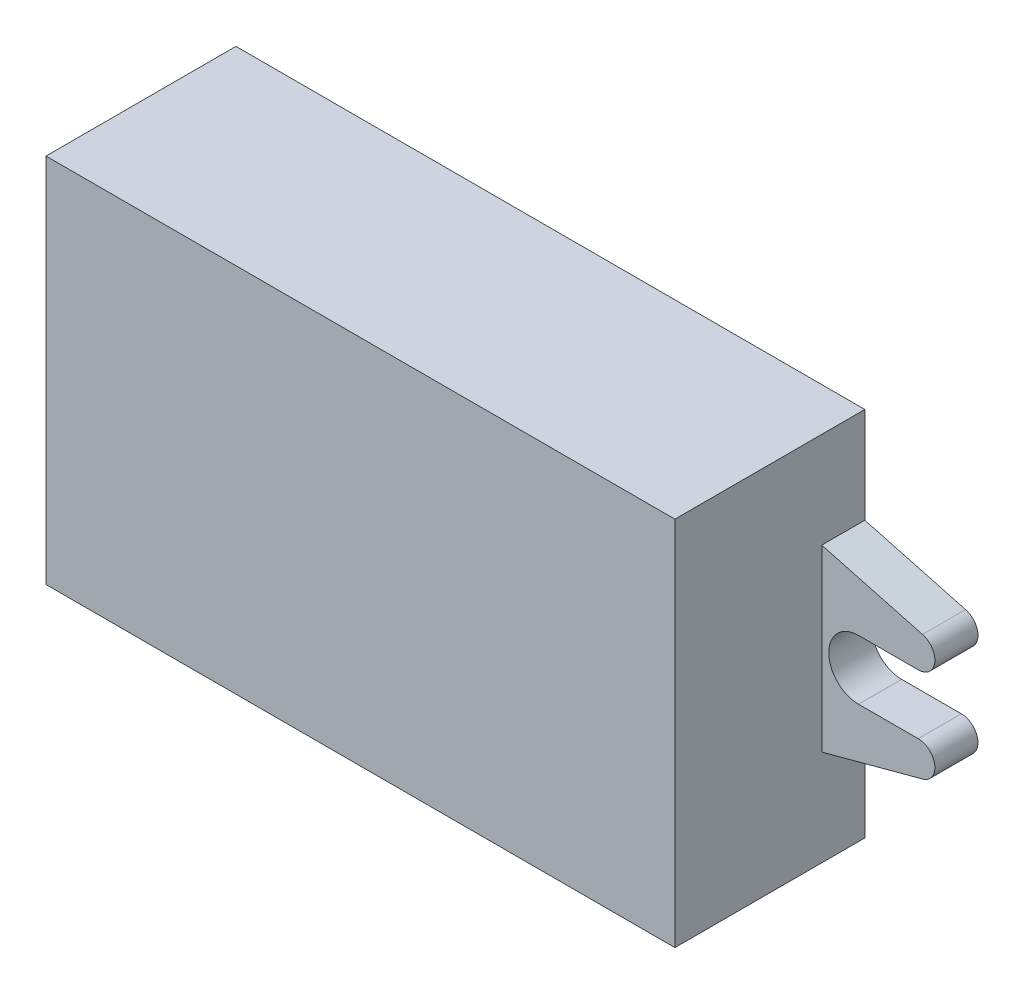
ISO-10303-21;
HEADER;
FILE_DESCRIPTION(('STEP AP214'),'2;1');
FILE_NAME('part.step','',(''),(''),'','','');
FILE_SCHEMA(('AUTOMOTIVE_DESIGN { 1 0 10303 214 1 1 1 1 }'));
ENDSEC;
DATA;
#1=APPLICATION_CONTEXT('core data for automotive mechanical design processes');
#2=APPLICATION_PROTOCOL_DEFINITION('international standard','automotive_design',2000,#1);
#3=PRODUCT_CONTEXT('',#1,'mechanical');
#4=PRODUCT('Part','Part','',(#3));
#5=PRODUCT_RELATED_PRODUCT_CATEGORY('part','',(#4));
#6=PRODUCT_DEFINITION_FORMATION('','',#4);
#7=PRODUCT_DEFINITION_CONTEXT('part definition',#1,'design');
#8=PRODUCT_DEFINITION('design','',#6,#7);
#9=PRODUCT_DEFINITION_SHAPE('','',#8);
#10=(LENGTH_UNIT() NAMED_UNIT(*) SI_UNIT(.MILLI.,.METRE.));
#11=(NAMED_UNIT(*) PLANE_ANGLE_UNIT() SI_UNIT($,.RADIAN.));
#12=(NAMED_UNIT(*) SI_UNIT($,.STERADIAN.) SOLID_ANGLE_UNIT());
#13=UNCERTAINTY_MEASURE_WITH_UNIT(LENGTH_MEASURE(1.E-05),#10,'distance_accuracy_value','');
#14=(GEOMETRIC_REPRESENTATION_CONTEXT(3) GLOBAL_UNCERTAINTY_ASSIGNED_CONTEXT((#13)) GLOBAL_UNIT_ASSIGNED_CONTEXT((#10,
#11,#12)) REPRESENTATION_CONTEXT('',''));
#15=CARTESIAN_POINT('',(0.,0.,0.));
#16=DIRECTION('',(0.,0.,1.));
#17=DIRECTION('',(1.,0.,0.));
#18=AXIS2_PLACEMENT_3D('',#15,#16,#17);
#19=CARTESIAN_POINT('',(-23.175,-13.675,14.));
#20=DIRECTION('',(1.,0.,0.));
#21=DIRECTION('',(0.,0.,-1.));
#22=AXIS2_PLACEMENT_3D('',#19,#20,#21);
#23=PLANE('',#22);
#24=DIRECTION('',(0.,0.,-1.));
#25=VECTOR('',#24,1.);
#26=CARTESIAN_POINT('',(-23.175,6.60413434886178,3.175));
#27=LINE('',#26,#25);
#28=CARTESIAN_POINT('',(-23.175,6.60413434886178,3.175));
#29=VERTEX_POINT('',#28);
#30=CARTESIAN_POINT('',(-23.175,6.60413434886178,0.));
#31=VERTEX_POINT('',#30);
#32=EDGE_CURVE('E192',#29,#31,#27,.T.);
#33=ORIENTED_EDGE('',*,*,#32,.F.);
#34=DIRECTION('',(0.,-1.,0.));
#35=VECTOR('',#34,1.);
#36=CARTESIAN_POINT('',(-23.175,6.60413434886178,3.175));
#37=LINE('',#36,#35);
#38=CARTESIAN_POINT('',(-23.175,-6.60413434886178,3.175));
#39=VERTEX_POINT('',#38);
#40=EDGE_CURVE('E177',#29,#39,#37,.T.);
#41=ORIENTED_EDGE('',*,*,#40,.T.);
#42=DIRECTION('',(0.,0.,-1.));
#43=VECTOR('',#42,1.);
#44=CARTESIAN_POINT('',(-23.175,-6.60413434886178,3.175));
#45=LINE('',#44,#43);
#46=CARTESIAN_POINT('',(-23.175,-6.60413434886178,0.));
#47=VERTEX_POINT('',#46);
#48=EDGE_CURVE('E313',#39,#47,#45,.T.);
#49=ORIENTED_EDGE('',*,*,#48,.T.);
#50=DIRECTION('',(0.,-1.,0.));
#51=VECTOR('',#50,1.);
#52=CARTESIAN_POINT('',(-23.175,-13.675,0.));
#53=LINE('',#52,#51);
#54=CARTESIAN_POINT('',(-23.175,-13.675,0.));
#55=VERTEX_POINT('',#54);
#56=EDGE_CURVE('E275',#47,#55,#53,.T.);
#57=ORIENTED_EDGE('',*,*,#56,.T.);
#58=DIRECTION('',(0.,0.,-1.));
#59=VECTOR('',#58,1.);
#60=CARTESIAN_POINT('',(-23.175,-13.675,14.));
#61=LINE('',#60,#59);
#62=CARTESIAN_POINT('',(-23.175,-13.675,14.));
#63=VERTEX_POINT('',#62);
#64=EDGE_CURVE('E280',#63,#55,#61,.T.);
#65=ORIENTED_EDGE('',*,*,#64,.F.);
#66=DIRECTION('',(0.,-1.,0.));
#67=VECTOR('',#66,1.);
#68=CARTESIAN_POINT('',(-23.175,-13.675,14.));
#69=LINE('',#68,#67);
#70=CARTESIAN_POINT('',(-23.175,13.675,14.));
#71=VERTEX_POINT('',#70);
#72=EDGE_CURVE('E265',#71,#63,#69,.T.);
#73=ORIENTED_EDGE('',*,*,#72,.F.);
#74=DIRECTION('',(0.,0.,-1.));
#75=VECTOR('',#74,1.);
#76=CARTESIAN_POINT('',(-23.175,13.675,14.));
#77=LINE('',#76,#75);
#78=CARTESIAN_POINT('',(-23.175,13.675,0.));
#79=VERTEX_POINT('',#78);
#80=EDGE_CURVE('E45',#71,#79,#77,.T.);
#81=ORIENTED_EDGE('',*,*,#80,.T.);
#82=EDGE_CURVE('E200',#79,#31,#53,.T.);
#83=ORIENTED_EDGE('',*,*,#82,.T.);
#84=EDGE_LOOP('',(#33,#41,#49,#57,#65,#73,#81,#83));
#85=FACE_BOUND('',#84,.T.);
#86=ADVANCED_FACE('F37',(#85),#23,.F.);
#87=CARTESIAN_POINT('',(23.175,-13.675,14.));
#88=DIRECTION('',(-1.,0.,0.));
#89=DIRECTION('',(0.,0.,1.));
#90=AXIS2_PLACEMENT_3D('',#87,#88,#89);
#91=PLANE('',#90);
#92=DIRECTION('',(0.,0.,-1.));
#93=VECTOR('',#92,1.);
#94=CARTESIAN_POINT('',(23.175,-6.60413434886178,3.175));
#95=LINE('',#94,#93);
#96=CARTESIAN_POINT('',(23.175,-6.60413434886178,3.175));
#97=VERTEX_POINT('',#96);
#98=CARTESIAN_POINT('',(23.175,-6.60413434886178,0.));
#99=VERTEX_POINT('',#98);
#100=EDGE_CURVE('E255',#97,#99,#95,.T.);
#101=ORIENTED_EDGE('',*,*,#100,.F.);
#102=DIRECTION('',(0.,-1.,0.));
#103=VECTOR('',#102,1.);
#104=CARTESIAN_POINT('',(23.175,6.60413434886178,3.175));
#105=LINE('',#104,#103);
#106=CARTESIAN_POINT('',(23.175,6.60413434886178,3.175));
#107=VERTEX_POINT('',#106);
#108=EDGE_CURVE('E209',#107,#97,#105,.T.);
#109=ORIENTED_EDGE('',*,*,#108,.F.);
#110=DIRECTION('',(0.,0.,-1.));
#111=VECTOR('',#110,1.);
#112=CARTESIAN_POINT('',(23.175,6.60413434886178,3.175));
#113=LINE('',#112,#111);
#114=CARTESIAN_POINT('',(23.175,6.60413434886178,0.));
#115=VERTEX_POINT('',#114);
#116=EDGE_CURVE('E225',#107,#115,#113,.T.);
#117=ORIENTED_EDGE('',*,*,#116,.T.);
#118=DIRECTION('',(0.,1.,0.));
#119=VECTOR('',#118,1.);
#120=CARTESIAN_POINT('',(23.175,-13.675,0.));
#121=LINE('',#120,#119);
#122=CARTESIAN_POINT('',(23.175,13.675,0.));
#123=VERTEX_POINT('',#122);
#124=EDGE_CURVE('E258',#115,#123,#121,.T.);
#125=ORIENTED_EDGE('',*,*,#124,.T.);
#126=DIRECTION('',(0.,0.,-1.));
#127=VECTOR('',#126,1.);
#128=CARTESIAN_POINT('',(23.175,13.675,14.));
#129=LINE('',#128,#127);
#130=CARTESIAN_POINT('',(23.175,13.675,14.));
#131=VERTEX_POINT('',#130);
#132=EDGE_CURVE('E11',#131,#123,#129,.T.);
#133=ORIENTED_EDGE('',*,*,#132,.F.);
#134=DIRECTION('',(0.,1.,0.));
#135=VECTOR('',#134,1.);
#136=CARTESIAN_POINT('',(23.175,-13.675,14.));
#137=LINE('',#136,#135);
#138=CARTESIAN_POINT('',(23.175,-13.675,14.));
#139=VERTEX_POINT('',#138);
#140=EDGE_CURVE('E259',#139,#131,#137,.T.);
#141=ORIENTED_EDGE('',*,*,#140,.F.);
#142=DIRECTION('',(0.,0.,-1.));
#143=VECTOR('',#142,1.);
#144=CARTESIAN_POINT('',(23.175,-13.675,14.));
#145=LINE('',#144,#143);
#146=CARTESIAN_POINT('',(23.175,-13.675,0.));
#147=VERTEX_POINT('',#146);
#148=EDGE_CURVE('E269',#139,#147,#145,.T.);
#149=ORIENTED_EDGE('',*,*,#148,.T.);
#150=EDGE_CURVE('E270',#147,#99,#121,.T.);
#151=ORIENTED_EDGE('',*,*,#150,.T.);
#152=EDGE_LOOP('',(#101,#109,#117,#125,#133,#141,#149,#151));
#153=FACE_BOUND('',#152,.T.);
#154=ADVANCED_FACE('F39',(#153),#91,.F.);
#155=CARTESIAN_POINT('',(-23.175,13.675,14.));
#156=DIRECTION('',(0.,-1.,0.));
#157=DIRECTION('',(0.,0.,-1.));
#158=AXIS2_PLACEMENT_3D('',#155,#156,#157);
#159=PLANE('',#158);
#160=DIRECTION('',(-1.,0.,0.));
#161=VECTOR('',#160,1.);
#162=CARTESIAN_POINT('',(-23.175,13.675,0.));
#163=LINE('',#162,#161);
#164=EDGE_CURVE('E273',#123,#79,#163,.T.);
#165=ORIENTED_EDGE('',*,*,#164,.T.);
#166=ORIENTED_EDGE('',*,*,#80,.F.);
#167=DIRECTION('',(-1.,0.,0.));
#168=VECTOR('',#167,1.);
#169=CARTESIAN_POINT('',(-23.175,13.675,14.));
#170=LINE('',#169,#168);
#171=EDGE_CURVE('E262',#131,#71,#170,.T.);
#172=ORIENTED_EDGE('',*,*,#171,.F.);
#173=ORIENTED_EDGE('',*,*,#132,.T.);
#174=EDGE_LOOP('',(#165,#166,#172,#173));
#175=FACE_BOUND('',#174,.T.);
#176=ADVANCED_FACE('F361',(#175),#159,.F.);
#177=CARTESIAN_POINT('',(-23.175,-13.675,14.));
#178=DIRECTION('',(0.,1.,0.));
#179=DIRECTION('',(0.,0.,1.));
#180=AXIS2_PLACEMENT_3D('',#177,#178,#179);
#181=PLANE('',#180);
#182=DIRECTION('',(1.,0.,0.));
#183=VECTOR('',#182,1.);
#184=CARTESIAN_POINT('',(-23.175,-13.675,0.));
#185=LINE('',#184,#183);
#186=EDGE_CURVE('E263',#55,#147,#185,.T.);
#187=ORIENTED_EDGE('',*,*,#186,.T.);
#188=ORIENTED_EDGE('',*,*,#148,.F.);
#189=DIRECTION('',(1.,0.,0.));
#190=VECTOR('',#189,1.);
#191=CARTESIAN_POINT('',(-23.175,-13.675,14.));
#192=LINE('',#191,#190);
#193=EDGE_CURVE('E267',#63,#139,#192,.T.);
#194=ORIENTED_EDGE('',*,*,#193,.F.);
#195=ORIENTED_EDGE('',*,*,#64,.T.);
#196=EDGE_LOOP('',(#187,#188,#194,#195));
#197=FACE_BOUND('',#196,.T.);
#198=ADVANCED_FACE('F353',(#197),#181,.F.);
#199=CARTESIAN_POINT('',(0.,0.,14.));
#200=DIRECTION('',(0.,0.,-1.));
#201=DIRECTION('',(-1.,0.,0.));
#202=AXIS2_PLACEMENT_3D('',#199,#200,#201);
#203=PLANE('',#202);
#204=ORIENTED_EDGE('',*,*,#140,.T.);
#205=ORIENTED_EDGE('',*,*,#171,.T.);
#206=ORIENTED_EDGE('',*,*,#72,.T.);
#207=ORIENTED_EDGE('',*,*,#193,.T.);
#208=EDGE_LOOP('',(#204,#205,#206,#207));
#209=FACE_BOUND('',#208,.T.);
#210=ADVANCED_FACE('F360',(#209),#203,.F.);
#211=CARTESIAN_POINT('',(0.,0.,0.));
#212=DIRECTION('',(0.,0.,-1.));
#213=DIRECTION('',(-1.,0.,0.));
#214=AXIS2_PLACEMENT_3D('',#211,#212,#213);
#215=PLANE('',#214);
#216=ORIENTED_EDGE('',*,*,#150,.F.);
#217=ORIENTED_EDGE('',*,*,#186,.F.);
#218=ORIENTED_EDGE('',*,*,#56,.F.);
#219=DIRECTION('',(-0.965925826289068,0.258819045102522,0.));
#220=VECTOR('',#219,1.);
#221=CARTESIAN_POINT('',(-23.175,-6.60413434886178,0.));
#222=LINE('',#221,#220);
#223=CARTESIAN_POINT('',(-30.6031740904172,-4.6137611000967,0.));
#224=VERTEX_POINT('',#223);
#225=EDGE_CURVE('E52',#47,#224,#222,.T.);
#226=ORIENTED_EDGE('',*,*,#225,.T.);
#227=CARTESIAN_POINT('',(-30.2847661366529,-3.42544643911438,0.));
#228=DIRECTION('',(0.,0.,-1.));
#229=DIRECTION('',(-1.,0.,0.));
#230=AXIS2_PLACEMENT_3D('',#227,#228,#229);
#231=CIRCLE('',#230,1.23023386334708);
#232=CARTESIAN_POINT('',(-30.2847661366529,-2.19521257576729,0.));
#233=VERTEX_POINT('',#232);
#234=EDGE_CURVE('E309',#224,#233,#231,.T.);
#235=ORIENTED_EDGE('',*,*,#234,.T.);
#236=DIRECTION('',(1.,0.,0.));
#237=VECTOR('',#236,1.);
#238=CARTESIAN_POINT('',(-30.2847661366529,-2.19521257576729,0.));
#239=LINE('',#238,#237);
#240=CARTESIAN_POINT('',(-25.8856526093128,-2.19521257576729,0.));
#241=VERTEX_POINT('',#240);
#242=EDGE_CURVE('E306',#233,#241,#239,.T.);
#243=ORIENTED_EDGE('',*,*,#242,.T.);
#244=CARTESIAN_POINT('',(-25.8856526093128,0.,0.));
#245=DIRECTION('',(0.,0.,1.));
#246=DIRECTION('',(-1.,0.,0.));
#247=AXIS2_PLACEMENT_3D('',#244,#245,#246);
#248=CIRCLE('',#247,2.19521257576729);
#249=CARTESIAN_POINT('',(-25.8856526093128,2.19521257576729,0.));
#250=VERTEX_POINT('',#249);
#251=EDGE_CURVE('E303',#241,#250,#248,.T.);
#252=ORIENTED_EDGE('',*,*,#251,.T.);
#253=DIRECTION('',(-1.,0.,0.));
#254=VECTOR('',#253,1.);
#255=CARTESIAN_POINT('',(-30.2847661366529,2.19521257576729,0.));
#256=LINE('',#255,#254);
#257=CARTESIAN_POINT('',(-30.2847661366529,2.1952125757673,0.));
#258=VERTEX_POINT('',#257);
#259=EDGE_CURVE('E297',#250,#258,#256,.T.);
#260=ORIENTED_EDGE('',*,*,#259,.T.);
#261=CARTESIAN_POINT('',(-30.2847661366529,3.42544643911438,0.));
#262=DIRECTION('',(0.,0.,-1.));
#263=DIRECTION('',(1.,0.,0.));
#264=AXIS2_PLACEMENT_3D('',#261,#262,#263);
#265=CIRCLE('',#264,1.23023386334708);
#266=CARTESIAN_POINT('',(-30.6031740904172,4.6137611000967,0.));
#267=VERTEX_POINT('',#266);
#268=EDGE_CURVE('E295',#258,#267,#265,.T.);
#269=ORIENTED_EDGE('',*,*,#268,.T.);
#270=DIRECTION('',(0.965925826289068,0.258819045102522,0.));
#271=VECTOR('',#270,1.);
#272=CARTESIAN_POINT('',(-23.175,6.60413434886178,0.));
#273=LINE('',#272,#271);
#274=EDGE_CURVE('E292',#267,#31,#273,.T.);
#275=ORIENTED_EDGE('',*,*,#274,.T.);
#276=ORIENTED_EDGE('',*,*,#82,.F.);
#277=ORIENTED_EDGE('',*,*,#164,.F.);
#278=ORIENTED_EDGE('',*,*,#124,.F.);
#279=DIRECTION('',(-0.965925826289068,0.258819045102522,0.));
#280=VECTOR('',#279,1.);
#281=CARTESIAN_POINT('',(23.175,6.60413434886178,0.));
#282=LINE('',#281,#280);
#283=CARTESIAN_POINT('',(30.6031740904172,4.6137611000967,0.));
#284=VERTEX_POINT('',#283);
#285=EDGE_CURVE('E60',#284,#115,#282,.T.);
#286=ORIENTED_EDGE('',*,*,#285,.F.);
#287=CARTESIAN_POINT('',(30.2847661366529,3.42544643911438,0.));
#288=DIRECTION('',(0.,0.,1.));
#289=DIRECTION('',(-1.,0.,0.));
#290=AXIS2_PLACEMENT_3D('',#287,#288,#289);
#291=CIRCLE('',#290,1.23023386334708);
#292=CARTESIAN_POINT('',(30.2847661366529,2.1952125757673,0.));
#293=VERTEX_POINT('',#292);
#294=EDGE_CURVE('E234',#293,#284,#291,.T.);
#295=ORIENTED_EDGE('',*,*,#294,.F.);
#296=DIRECTION('',(1.,0.,0.));
#297=VECTOR('',#296,1.);
#298=CARTESIAN_POINT('',(30.2847661366529,2.19521257576729,0.));
#299=LINE('',#298,#297);
#300=CARTESIAN_POINT('',(25.8856526093128,2.19521257576729,0.));
#301=VERTEX_POINT('',#300);
#302=EDGE_CURVE('E232',#301,#293,#299,.T.);
#303=ORIENTED_EDGE('',*,*,#302,.F.);
#304=CARTESIAN_POINT('',(25.8856526093128,0.,0.));
#305=DIRECTION('',(0.,0.,-1.));
#306=DIRECTION('',(1.,0.,0.));
#307=AXIS2_PLACEMENT_3D('',#304,#305,#306);
#308=CIRCLE('',#307,2.19521257576729);
#309=CARTESIAN_POINT('',(25.8856526093128,-2.19521257576729,0.));
#310=VERTEX_POINT('',#309);
#311=EDGE_CURVE('E230',#310,#301,#308,.T.);
#312=ORIENTED_EDGE('',*,*,#311,.F.);
#313=DIRECTION('',(-1.,0.,0.));
#314=VECTOR('',#313,1.);
#315=CARTESIAN_POINT('',(30.2847661366529,-2.19521257576729,0.));
#316=LINE('',#315,#314);
#317=CARTESIAN_POINT('',(30.2847661366529,-2.19521257576729,0.));
#318=VERTEX_POINT('',#317);
#319=EDGE_CURVE('E228',#318,#310,#316,.T.);
#320=ORIENTED_EDGE('',*,*,#319,.F.);
#321=CARTESIAN_POINT('',(30.2847661366529,-3.42544643911438,0.));
#322=DIRECTION('',(0.,0.,1.));
#323=DIRECTION('',(1.,0.,0.));
#324=AXIS2_PLACEMENT_3D('',#321,#322,#323);
#325=CIRCLE('',#324,1.23023386334708);
#326=CARTESIAN_POINT('',(30.6031740904172,-4.6137611000967,0.));
#327=VERTEX_POINT('',#326);
#328=EDGE_CURVE('E203',#327,#318,#325,.T.);
#329=ORIENTED_EDGE('',*,*,#328,.F.);
#330=DIRECTION('',(0.965925826289068,0.258819045102522,0.));
#331=VECTOR('',#330,1.);
#332=CARTESIAN_POINT('',(23.175,-6.60413434886178,0.));
#333=LINE('',#332,#331);
#334=EDGE_CURVE('E201',#99,#327,#333,.T.);
#335=ORIENTED_EDGE('',*,*,#334,.F.);
#336=EDGE_LOOP('',(#216,#217,#218,#226,#235,#243,#252,#260,#269,#275,#276,#277,#278,#286,#295,
#303,#312,#320,#329,#335));
#337=FACE_BOUND('',#336,.T.);
#338=ADVANCED_FACE('F289',(#337),#215,.T.);
#339=CARTESIAN_POINT('',(23.175,-6.60413434886178,3.175));
#340=DIRECTION('',(-0.258819045102522,0.965925826289068,0.));
#341=DIRECTION('',(-0.965925826289068,-0.258819045102522,0.));
#342=AXIS2_PLACEMENT_3D('',#339,#340,#341);
#343=PLANE('',#342);
#344=ORIENTED_EDGE('',*,*,#334,.T.);
#345=DIRECTION('',(0.,0.,-1.));
#346=VECTOR('',#345,1.);
#347=CARTESIAN_POINT('',(30.6031740904172,-4.6137611000967,3.175));
#348=LINE('',#347,#346);
#349=CARTESIAN_POINT('',(30.6031740904172,-4.6137611000967,3.175));
#350=VERTEX_POINT('',#349);
#351=EDGE_CURVE('E252',#350,#327,#348,.T.);
#352=ORIENTED_EDGE('',*,*,#351,.F.);
#353=DIRECTION('',(0.965925826289068,0.258819045102522,0.));
#354=VECTOR('',#353,1.);
#355=CARTESIAN_POINT('',(23.175,-6.60413434886178,3.175));
#356=LINE('',#355,#354);
#357=EDGE_CURVE('E212',#97,#350,#356,.T.);
#358=ORIENTED_EDGE('',*,*,#357,.F.);
#359=ORIENTED_EDGE('',*,*,#100,.T.);
#360=EDGE_LOOP('',(#344,#352,#358,#359));
#361=FACE_BOUND('',#360,.T.);
#362=ADVANCED_FACE('F375',(#361),#343,.F.);
#363=CARTESIAN_POINT('',(30.2847661366529,-3.42544643911438,3.175));
#364=DIRECTION('',(0.,0.,-1.));
#365=DIRECTION('',(-1.,0.,0.));
#366=AXIS2_PLACEMENT_3D('',#363,#364,#365);
#367=CYLINDRICAL_SURFACE('',#366,1.23023386334708);
#368=ORIENTED_EDGE('',*,*,#328,.T.);
#369=DIRECTION('',(0.,0.,-1.));
#370=VECTOR('',#369,1.);
#371=CARTESIAN_POINT('',(30.2847661366529,-2.19521257576729,3.175));
#372=LINE('',#371,#370);
#373=CARTESIAN_POINT('',(30.2847661366529,-2.19521257576729,3.175));
#374=VERTEX_POINT('',#373);
#375=EDGE_CURVE('E249',#374,#318,#372,.T.);
#376=ORIENTED_EDGE('',*,*,#375,.F.);
#377=CARTESIAN_POINT('',(30.2847661366529,-3.42544643911438,3.175));
#378=DIRECTION('',(0.,0.,1.));
#379=DIRECTION('',(1.,0.,0.));
#380=AXIS2_PLACEMENT_3D('',#377,#378,#379);
#381=CIRCLE('',#380,1.23023386334708);
#382=EDGE_CURVE('E214',#350,#374,#381,.T.);
#383=ORIENTED_EDGE('',*,*,#382,.F.);
#384=ORIENTED_EDGE('',*,*,#351,.T.);
#385=EDGE_LOOP('',(#368,#376,#383,#384));
#386=FACE_BOUND('',#385,.T.);
#387=ADVANCED_FACE('F380',(#386),#367,.T.);
#388=CARTESIAN_POINT('',(30.2847661366529,-2.19521257576729,3.175));
#389=DIRECTION('',(0.,-1.,0.));
#390=DIRECTION('',(1.,0.,0.));
#391=AXIS2_PLACEMENT_3D('',#388,#389,#390);
#392=PLANE('',#391);
#393=ORIENTED_EDGE('',*,*,#319,.T.);
#394=DIRECTION('',(0.,0.,-1.));
#395=VECTOR('',#394,1.);
#396=CARTESIAN_POINT('',(25.8856526093128,-2.19521257576729,3.175));
#397=LINE('',#396,#395);
#398=CARTESIAN_POINT('',(25.8856526093128,-2.19521257576729,3.175));
#399=VERTEX_POINT('',#398);
#400=EDGE_CURVE('E246',#399,#310,#397,.T.);
#401=ORIENTED_EDGE('',*,*,#400,.F.);
#402=DIRECTION('',(-1.,0.,0.));
#403=VECTOR('',#402,1.);
#404=CARTESIAN_POINT('',(30.2847661366529,-2.19521257576729,3.175));
#405=LINE('',#404,#403);
#406=EDGE_CURVE('E216',#374,#399,#405,.T.);
#407=ORIENTED_EDGE('',*,*,#406,.F.);
#408=ORIENTED_EDGE('',*,*,#375,.T.);
#409=EDGE_LOOP('',(#393,#401,#407,#408));
#410=FACE_BOUND('',#409,.T.);
#411=ADVANCED_FACE('F384',(#410),#392,.F.);
#412=CARTESIAN_POINT('',(25.8856526093128,0.,3.175));
#413=DIRECTION('',(0.,0.,-1.));
#414=DIRECTION('',(-1.,0.,0.));
#415=AXIS2_PLACEMENT_3D('',#412,#413,#414);
#416=CYLINDRICAL_SURFACE('',#415,2.19521257576729);
#417=ORIENTED_EDGE('',*,*,#311,.T.);
#418=DIRECTION('',(0.,0.,-1.));
#419=VECTOR('',#418,1.);
#420=CARTESIAN_POINT('',(25.8856526093128,2.19521257576729,3.175));
#421=LINE('',#420,#419);
#422=CARTESIAN_POINT('',(25.8856526093128,2.19521257576729,3.175));
#423=VERTEX_POINT('',#422);
#424=EDGE_CURVE('E243',#423,#301,#421,.T.);
#425=ORIENTED_EDGE('',*,*,#424,.F.);
#426=CARTESIAN_POINT('',(25.8856526093128,0.,3.175));
#427=DIRECTION('',(0.,0.,-1.));
#428=DIRECTION('',(1.,0.,0.));
#429=AXIS2_PLACEMENT_3D('',#426,#427,#428);
#430=CIRCLE('',#429,2.19521257576729);
#431=EDGE_CURVE('E218',#399,#423,#430,.T.);
#432=ORIENTED_EDGE('',*,*,#431,.F.);
#433=ORIENTED_EDGE('',*,*,#400,.T.);
#434=EDGE_LOOP('',(#417,#425,#432,#433));
#435=FACE_BOUND('',#434,.T.);
#436=ADVANCED_FACE('F388',(#435),#416,.F.);
#437=CARTESIAN_POINT('',(30.2847661366529,2.19521257576729,3.175));
#438=DIRECTION('',(0.,1.,0.));
#439=DIRECTION('',(-1.,0.,0.));
#440=AXIS2_PLACEMENT_3D('',#437,#438,#439);
#441=PLANE('',#440);
#442=ORIENTED_EDGE('',*,*,#302,.T.);
#443=DIRECTION('',(0.,0.,-1.));
#444=VECTOR('',#443,1.);
#445=CARTESIAN_POINT('',(30.2847661366529,2.1952125757673,3.175));
#446=LINE('',#445,#444);
#447=CARTESIAN_POINT('',(30.2847661366529,2.1952125757673,3.175));
#448=VERTEX_POINT('',#447);
#449=EDGE_CURVE('E240',#448,#293,#446,.T.);
#450=ORIENTED_EDGE('',*,*,#449,.F.);
#451=DIRECTION('',(1.,0.,0.));
#452=VECTOR('',#451,1.);
#453=CARTESIAN_POINT('',(30.2847661366529,2.19521257576729,3.175));
#454=LINE('',#453,#452);
#455=EDGE_CURVE('E220',#423,#448,#454,.T.);
#456=ORIENTED_EDGE('',*,*,#455,.F.);
#457=ORIENTED_EDGE('',*,*,#424,.T.);
#458=EDGE_LOOP('',(#442,#450,#456,#457));
#459=FACE_BOUND('',#458,.T.);
#460=ADVANCED_FACE('F392',(#459),#441,.F.);
#461=CARTESIAN_POINT('',(30.2847661366529,3.42544643911438,3.175));
#462=DIRECTION('',(0.,0.,-1.));
#463=DIRECTION('',(-1.,0.,0.));
#464=AXIS2_PLACEMENT_3D('',#461,#462,#463);
#465=CYLINDRICAL_SURFACE('',#464,1.23023386334708);
#466=ORIENTED_EDGE('',*,*,#294,.T.);
#467=DIRECTION('',(0.,0.,-1.));
#468=VECTOR('',#467,1.);
#469=CARTESIAN_POINT('',(30.6031740904172,4.6137611000967,3.175));
#470=LINE('',#469,#468);
#471=CARTESIAN_POINT('',(30.6031740904172,4.6137611000967,3.175));
#472=VERTEX_POINT('',#471);
#473=EDGE_CURVE('E238',#472,#284,#470,.T.);
#474=ORIENTED_EDGE('',*,*,#473,.F.);
#475=CARTESIAN_POINT('',(30.2847661366529,3.42544643911438,3.175));
#476=DIRECTION('',(0.,0.,1.));
#477=DIRECTION('',(-1.,0.,0.));
#478=AXIS2_PLACEMENT_3D('',#475,#476,#477);
#479=CIRCLE('',#478,1.23023386334708);
#480=EDGE_CURVE('E222',#448,#472,#479,.T.);
#481=ORIENTED_EDGE('',*,*,#480,.F.);
#482=ORIENTED_EDGE('',*,*,#449,.T.);
#483=EDGE_LOOP('',(#466,#474,#481,#482));
#484=FACE_BOUND('',#483,.T.);
#485=ADVANCED_FACE('F396',(#484),#465,.T.);
#486=CARTESIAN_POINT('',(23.175,6.60413434886178,3.175));
#487=DIRECTION('',(-0.258819045102522,-0.965925826289068,0.));
#488=DIRECTION('',(0.965925826289068,-0.258819045102522,0.));
#489=AXIS2_PLACEMENT_3D('',#486,#487,#488);
#490=PLANE('',#489);
#491=ORIENTED_EDGE('',*,*,#285,.T.);
#492=ORIENTED_EDGE('',*,*,#116,.F.);
#493=DIRECTION('',(-0.965925826289068,0.258819045102522,0.));
#494=VECTOR('',#493,1.);
#495=CARTESIAN_POINT('',(23.175,6.60413434886178,3.175));
#496=LINE('',#495,#494);
#497=EDGE_CURVE('E224',#472,#107,#496,.T.);
#498=ORIENTED_EDGE('',*,*,#497,.F.);
#499=ORIENTED_EDGE('',*,*,#473,.T.);
#500=EDGE_LOOP('',(#491,#492,#498,#499));
#501=FACE_BOUND('',#500,.T.);
#502=ADVANCED_FACE('F400',(#501),#490,.F.);
#503=CARTESIAN_POINT('',(30.2847661366529,-3.42544643911438,3.175));
#504=DIRECTION('',(0.,0.,1.));
#505=DIRECTION('',(1.,0.,0.));
#506=AXIS2_PLACEMENT_3D('',#503,#504,#505);
#507=PLANE('',#506);
#508=ORIENTED_EDGE('',*,*,#108,.T.);
#509=ORIENTED_EDGE('',*,*,#357,.T.);
#510=ORIENTED_EDGE('',*,*,#382,.T.);
#511=ORIENTED_EDGE('',*,*,#406,.T.);
#512=ORIENTED_EDGE('',*,*,#431,.T.);
#513=ORIENTED_EDGE('',*,*,#455,.T.);
#514=ORIENTED_EDGE('',*,*,#480,.T.);
#515=ORIENTED_EDGE('',*,*,#497,.T.);
#516=EDGE_LOOP('',(#508,#509,#510,#511,#512,#513,#514,#515));
#517=FACE_BOUND('',#516,.T.);
#518=ADVANCED_FACE('F404',(#517),#507,.T.);
#519=CARTESIAN_POINT('',(-23.175,6.60413434886178,3.175));
#520=DIRECTION('',(-0.258819045102522,0.965925826289068,0.));
#521=DIRECTION('',(-0.965925826289068,-0.258819045102522,0.));
#522=AXIS2_PLACEMENT_3D('',#519,#520,#521);
#523=PLANE('',#522);
#524=ORIENTED_EDGE('',*,*,#274,.F.);
#525=DIRECTION('',(0.,0.,-1.));
#526=VECTOR('',#525,1.);
#527=CARTESIAN_POINT('',(-30.6031740904172,4.6137611000967,3.175));
#528=LINE('',#527,#526);
#529=CARTESIAN_POINT('',(-30.6031740904172,4.6137611000967,3.175));
#530=VERTEX_POINT('',#529);
#531=EDGE_CURVE('E194',#530,#267,#528,.T.);
#532=ORIENTED_EDGE('',*,*,#531,.F.);
#533=DIRECTION('',(0.965925826289068,0.258819045102522,0.));
#534=VECTOR('',#533,1.);
#535=CARTESIAN_POINT('',(-23.175,6.60413434886178,3.175));
#536=LINE('',#535,#534);
#537=EDGE_CURVE('E181',#530,#29,#536,.T.);
#538=ORIENTED_EDGE('',*,*,#537,.T.);
#539=ORIENTED_EDGE('',*,*,#32,.T.);
#540=EDGE_LOOP('',(#524,#532,#538,#539));
#541=FACE_BOUND('',#540,.T.);
#542=ADVANCED_FACE('F191',(#541),#523,.T.);
#543=CARTESIAN_POINT('',(-30.2847661366529,3.42544643911438,3.175));
#544=DIRECTION('',(0.,0.,-1.));
#545=DIRECTION('',(-1.,0.,0.));
#546=AXIS2_PLACEMENT_3D('',#543,#544,#545);
#547=CYLINDRICAL_SURFACE('',#546,1.23023386334708);
#548=ORIENTED_EDGE('',*,*,#268,.F.);
#549=DIRECTION('',(0.,0.,-1.));
#550=VECTOR('',#549,1.);
#551=CARTESIAN_POINT('',(-30.2847661366529,2.1952125757673,3.175));
#552=LINE('',#551,#550);
#553=CARTESIAN_POINT('',(-30.2847661366529,2.1952125757673,3.175));
#554=VERTEX_POINT('',#553);
#555=EDGE_CURVE('E205',#554,#258,#552,.T.);
#556=ORIENTED_EDGE('',*,*,#555,.F.);
#557=CARTESIAN_POINT('',(-30.2847661366529,3.42544643911438,3.175));
#558=DIRECTION('',(0.,0.,-1.));
#559=DIRECTION('',(1.,0.,0.));
#560=AXIS2_PLACEMENT_3D('',#557,#558,#559);
#561=CIRCLE('',#560,1.23023386334708);
#562=EDGE_CURVE('E195',#554,#530,#561,.T.);
#563=ORIENTED_EDGE('',*,*,#562,.T.);
#564=ORIENTED_EDGE('',*,*,#531,.T.);
#565=EDGE_LOOP('',(#548,#556,#563,#564));
#566=FACE_BOUND('',#565,.T.);
#567=ADVANCED_FACE('F329',(#566),#547,.T.);
#568=CARTESIAN_POINT('',(-30.2847661366529,2.19521257576729,3.175));
#569=DIRECTION('',(0.,-1.,0.));
#570=DIRECTION('',(1.,0.,0.));
#571=AXIS2_PLACEMENT_3D('',#568,#569,#570);
#572=PLANE('',#571);
#573=ORIENTED_EDGE('',*,*,#259,.F.);
#574=DIRECTION('',(0.,0.,-1.));
#575=VECTOR('',#574,1.);
#576=CARTESIAN_POINT('',(-25.8856526093128,2.19521257576729,3.175));
#577=LINE('',#576,#575);
#578=CARTESIAN_POINT('',(-25.8856526093128,2.19521257576729,3.175));
#579=VERTEX_POINT('',#578);
#580=EDGE_CURVE('E321',#579,#250,#577,.T.);
#581=ORIENTED_EDGE('',*,*,#580,.F.);
#582=DIRECTION('',(-1.,0.,0.));
#583=VECTOR('',#582,1.);
#584=CARTESIAN_POINT('',(-30.2847661366529,2.19521257576729,3.175));
#585=LINE('',#584,#583);
#586=EDGE_CURVE('E327',#579,#554,#585,.T.);
#587=ORIENTED_EDGE('',*,*,#586,.T.);
#588=ORIENTED_EDGE('',*,*,#555,.T.);
#589=EDGE_LOOP('',(#573,#581,#587,#588));
#590=FACE_BOUND('',#589,.T.);
#591=ADVANCED_FACE('F325',(#590),#572,.T.);
#592=CARTESIAN_POINT('',(-25.8856526093128,0.,3.175));
#593=DIRECTION('',(0.,0.,-1.));
#594=DIRECTION('',(-1.,0.,0.));
#595=AXIS2_PLACEMENT_3D('',#592,#593,#594);
#596=CYLINDRICAL_SURFACE('',#595,2.19521257576729);
#597=ORIENTED_EDGE('',*,*,#251,.F.);
#598=DIRECTION('',(0.,0.,-1.));
#599=VECTOR('',#598,1.);
#600=CARTESIAN_POINT('',(-25.8856526093128,-2.19521257576729,3.175));
#601=LINE('',#600,#599);
#602=CARTESIAN_POINT('',(-25.8856526093128,-2.19521257576729,3.175));
#603=VERTEX_POINT('',#602);
#604=EDGE_CURVE('E319',#603,#241,#601,.T.);
#605=ORIENTED_EDGE('',*,*,#604,.F.);
#606=CARTESIAN_POINT('',(-25.8856526093128,0.,3.175));
#607=DIRECTION('',(0.,0.,1.));
#608=DIRECTION('',(-1.,0.,0.));
#609=AXIS2_PLACEMENT_3D('',#606,#607,#608);
#610=CIRCLE('',#609,2.19521257576729);
#611=EDGE_CURVE('E336',#603,#579,#610,.T.);
#612=ORIENTED_EDGE('',*,*,#611,.T.);
#613=ORIENTED_EDGE('',*,*,#580,.T.);
#614=EDGE_LOOP('',(#597,#605,#612,#613));
#615=FACE_BOUND('',#614,.T.);
#616=ADVANCED_FACE('F333',(#615),#596,.F.);
#617=CARTESIAN_POINT('',(-30.2847661366529,-2.19521257576729,3.175));
#618=DIRECTION('',(0.,1.,0.));
#619=DIRECTION('',(-1.,0.,0.));
#620=AXIS2_PLACEMENT_3D('',#617,#618,#619);
#621=PLANE('',#620);
#622=ORIENTED_EDGE('',*,*,#242,.F.);
#623=DIRECTION('',(0.,0.,-1.));
#624=VECTOR('',#623,1.);
#625=CARTESIAN_POINT('',(-30.2847661366529,-2.19521257576729,3.175));
#626=LINE('',#625,#624);
#627=CARTESIAN_POINT('',(-30.2847661366529,-2.19521257576729,3.175));
#628=VERTEX_POINT('',#627);
#629=EDGE_CURVE('E317',#628,#233,#626,.T.);
#630=ORIENTED_EDGE('',*,*,#629,.F.);
#631=DIRECTION('',(1.,0.,0.));
#632=VECTOR('',#631,1.);
#633=CARTESIAN_POINT('',(-30.2847661366529,-2.19521257576729,3.175));
#634=LINE('',#633,#632);
#635=EDGE_CURVE('E340',#628,#603,#634,.T.);
#636=ORIENTED_EDGE('',*,*,#635,.T.);
#637=ORIENTED_EDGE('',*,*,#604,.T.);
#638=EDGE_LOOP('',(#622,#630,#636,#637));
#639=FACE_BOUND('',#638,.T.);
#640=ADVANCED_FACE('F416',(#639),#621,.T.);
#641=CARTESIAN_POINT('',(-30.2847661366529,-3.42544643911438,3.175));
#642=DIRECTION('',(0.,0.,-1.));
#643=DIRECTION('',(-1.,0.,0.));
#644=AXIS2_PLACEMENT_3D('',#641,#642,#643);
#645=CYLINDRICAL_SURFACE('',#644,1.23023386334708);
#646=ORIENTED_EDGE('',*,*,#234,.F.);
#647=DIRECTION('',(0.,0.,-1.));
#648=VECTOR('',#647,1.);
#649=CARTESIAN_POINT('',(-30.6031740904172,-4.6137611000967,3.175));
#650=LINE('',#649,#648);
#651=CARTESIAN_POINT('',(-30.6031740904172,-4.6137611000967,3.175));
#652=VERTEX_POINT('',#651);
#653=EDGE_CURVE('E315',#652,#224,#650,.T.);
#654=ORIENTED_EDGE('',*,*,#653,.F.);
#655=CARTESIAN_POINT('',(-30.2847661366529,-3.42544643911438,3.175));
#656=DIRECTION('',(0.,0.,-1.));
#657=DIRECTION('',(-1.,0.,0.));
#658=AXIS2_PLACEMENT_3D('',#655,#656,#657);
#659=CIRCLE('',#658,1.23023386334708);
#660=EDGE_CURVE('E344',#652,#628,#659,.T.);
#661=ORIENTED_EDGE('',*,*,#660,.T.);
#662=ORIENTED_EDGE('',*,*,#629,.T.);
#663=EDGE_LOOP('',(#646,#654,#661,#662));
#664=FACE_BOUND('',#663,.T.);
#665=ADVANCED_FACE('F419',(#664),#645,.T.);
#666=CARTESIAN_POINT('',(-23.175,-6.60413434886178,3.175));
#667=DIRECTION('',(-0.258819045102522,-0.965925826289068,0.));
#668=DIRECTION('',(0.965925826289068,-0.258819045102522,0.));
#669=AXIS2_PLACEMENT_3D('',#666,#667,#668);
#670=PLANE('',#669);
#671=ORIENTED_EDGE('',*,*,#225,.F.);
#672=ORIENTED_EDGE('',*,*,#48,.F.);
#673=DIRECTION('',(-0.965925826289068,0.258819045102522,0.));
#674=VECTOR('',#673,1.);
#675=CARTESIAN_POINT('',(-23.175,-6.60413434886178,3.175));
#676=LINE('',#675,#674);
#677=EDGE_CURVE('E185',#39,#652,#676,.T.);
#678=ORIENTED_EDGE('',*,*,#677,.T.);
#679=ORIENTED_EDGE('',*,*,#653,.T.);
#680=EDGE_LOOP('',(#671,#672,#678,#679));
#681=FACE_BOUND('',#680,.T.);
#682=ADVANCED_FACE('F347',(#681),#670,.T.);
#683=CARTESIAN_POINT('',(-30.2847661366529,-3.42544643911438,3.175));
#684=DIRECTION('',(0.,0.,1.));
#685=DIRECTION('',(-1.,0.,0.));
#686=AXIS2_PLACEMENT_3D('',#683,#684,#685);
#687=PLANE('',#686);
#688=ORIENTED_EDGE('',*,*,#40,.F.);
#689=ORIENTED_EDGE('',*,*,#537,.F.);
#690=ORIENTED_EDGE('',*,*,#562,.F.);
#691=ORIENTED_EDGE('',*,*,#586,.F.);
#692=ORIENTED_EDGE('',*,*,#611,.F.);
#693=ORIENTED_EDGE('',*,*,#635,.F.);
#694=ORIENTED_EDGE('',*,*,#660,.F.);
#695=ORIENTED_EDGE('',*,*,#677,.F.);
#696=EDGE_LOOP('',(#688,#689,#690,#691,#692,#693,#694,#695));
#697=FACE_BOUND('',#696,.T.);
#698=ADVANCED_FACE('F179',(#697),#687,.T.);
#699=CLOSED_SHELL('',(#86,#154,#176,#198,#210,#338,#362,#387,#411,#436,#460,#485,#502,#518,#542,
#567,#591,#616,#640,#665,#682,#698));
#700=MANIFOLD_SOLID_BREP('B2',#699);
#701=ADVANCED_BREP_SHAPE_REPRESENTATION('',(#18,#700),#14);
#702=SHAPE_DEFINITION_REPRESENTATION(#9,#701);
ENDSEC;
END-ISO-10303-21;
